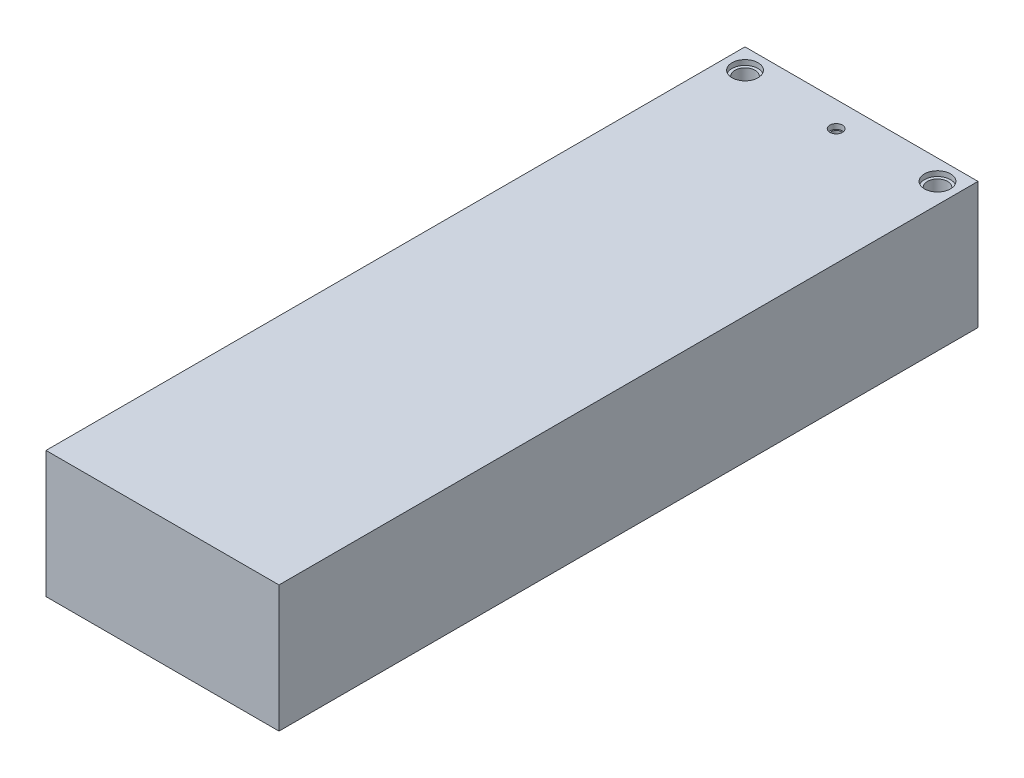
ISO-10303-21;
HEADER;
FILE_DESCRIPTION(('STEP AP214'),'2;1');
FILE_NAME('part.step','',(''),(''),'','','');
FILE_SCHEMA(('AUTOMOTIVE_DESIGN { 1 0 10303 214 1 1 1 1 }'));
ENDSEC;
DATA;
#1=APPLICATION_CONTEXT('core data for automotive mechanical design processes');
#2=APPLICATION_PROTOCOL_DEFINITION('international standard','automotive_design',2000,#1);
#3=PRODUCT_CONTEXT('',#1,'mechanical');
#4=PRODUCT('Part','Part','',(#3));
#5=PRODUCT_RELATED_PRODUCT_CATEGORY('part','',(#4));
#6=PRODUCT_DEFINITION_FORMATION('','',#4);
#7=PRODUCT_DEFINITION_CONTEXT('part definition',#1,'design');
#8=PRODUCT_DEFINITION('design','',#6,#7);
#9=PRODUCT_DEFINITION_SHAPE('','',#8);
#10=(LENGTH_UNIT() NAMED_UNIT(*) SI_UNIT(.MILLI.,.METRE.));
#11=(NAMED_UNIT(*) PLANE_ANGLE_UNIT() SI_UNIT($,.RADIAN.));
#12=(NAMED_UNIT(*) SI_UNIT($,.STERADIAN.) SOLID_ANGLE_UNIT());
#13=UNCERTAINTY_MEASURE_WITH_UNIT(LENGTH_MEASURE(1.E-05),#10,'distance_accuracy_value','');
#14=(GEOMETRIC_REPRESENTATION_CONTEXT(3) GLOBAL_UNCERTAINTY_ASSIGNED_CONTEXT((#13)) GLOBAL_UNIT_ASSIGNED_CONTEXT((#10,
#11,#12)) REPRESENTATION_CONTEXT('',''));
#15=CARTESIAN_POINT('',(0.,0.,0.));
#16=DIRECTION('',(0.,0.,1.));
#17=DIRECTION('',(1.,0.,0.));
#18=AXIS2_PLACEMENT_3D('',#15,#16,#17);
#19=CARTESIAN_POINT('',(-23.,12.5,138.));
#20=DIRECTION('',(1.,0.,0.));
#21=DIRECTION('',(0.,1.,0.));
#22=AXIS2_PLACEMENT_3D('',#19,#20,#21);
#23=PLANE('',#22);
#24=DIRECTION('',(0.,-1.,0.));
#25=VECTOR('',#24,1.);
#26=CARTESIAN_POINT('',(-23.,12.5,0.));
#27=LINE('',#26,#25);
#28=CARTESIAN_POINT('',(-23.,12.5,0.));
#29=VERTEX_POINT('',#28);
#30=CARTESIAN_POINT('',(-23.,-12.5,0.));
#31=VERTEX_POINT('',#30);
#32=EDGE_CURVE('E103',#29,#31,#27,.T.);
#33=ORIENTED_EDGE('',*,*,#32,.T.);
#34=DIRECTION('',(0.,0.,-1.));
#35=VECTOR('',#34,1.);
#36=CARTESIAN_POINT('',(-23.,-12.5,138.));
#37=LINE('',#36,#35);
#38=CARTESIAN_POINT('',(-23.,-12.5,138.));
#39=VERTEX_POINT('',#38);
#40=EDGE_CURVE('E11',#39,#31,#37,.T.);
#41=ORIENTED_EDGE('',*,*,#40,.F.);
#42=DIRECTION('',(0.,-1.,0.));
#43=VECTOR('',#42,1.);
#44=CARTESIAN_POINT('',(-23.,12.5,138.));
#45=LINE('',#44,#43);
#46=CARTESIAN_POINT('',(-23.,12.5,138.));
#47=VERTEX_POINT('',#46);
#48=EDGE_CURVE('E90',#47,#39,#45,.T.);
#49=ORIENTED_EDGE('',*,*,#48,.F.);
#50=DIRECTION('',(0.,0.,-1.));
#51=VECTOR('',#50,1.);
#52=CARTESIAN_POINT('',(-23.,12.5,138.));
#53=LINE('',#52,#51);
#54=EDGE_CURVE('E99',#47,#29,#53,.T.);
#55=ORIENTED_EDGE('',*,*,#54,.T.);
#56=EDGE_LOOP('',(#33,#41,#49,#55));
#57=FACE_BOUND('',#56,.T.);
#58=ADVANCED_FACE('F37',(#57),#23,.F.);
#59=CARTESIAN_POINT('',(-23.,-12.5,138.));
#60=DIRECTION('',(0.,1.,0.));
#61=DIRECTION('',(-1.,0.,0.));
#62=AXIS2_PLACEMENT_3D('',#59,#60,#61);
#63=PLANE('',#62);
#64=DIRECTION('',(1.,0.,0.));
#65=VECTOR('',#64,1.);
#66=CARTESIAN_POINT('',(-23.,-12.5,0.));
#67=LINE('',#66,#65);
#68=CARTESIAN_POINT('',(23.,-12.5,0.));
#69=VERTEX_POINT('',#68);
#70=EDGE_CURVE('E94',#31,#69,#67,.T.);
#71=ORIENTED_EDGE('',*,*,#70,.T.);
#72=DIRECTION('',(0.,0.,-1.));
#73=VECTOR('',#72,1.);
#74=CARTESIAN_POINT('',(23.,-12.5,138.));
#75=LINE('',#74,#73);
#76=CARTESIAN_POINT('',(23.,-12.5,138.));
#77=VERTEX_POINT('',#76);
#78=EDGE_CURVE('E46',#77,#69,#75,.T.);
#79=ORIENTED_EDGE('',*,*,#78,.F.);
#80=DIRECTION('',(1.,0.,0.));
#81=VECTOR('',#80,1.);
#82=CARTESIAN_POINT('',(-23.,-12.5,138.));
#83=LINE('',#82,#81);
#84=EDGE_CURVE('E85',#39,#77,#83,.T.);
#85=ORIENTED_EDGE('',*,*,#84,.F.);
#86=ORIENTED_EDGE('',*,*,#40,.T.);
#87=EDGE_LOOP('',(#71,#79,#85,#86));
#88=FACE_BOUND('',#87,.T.);
#89=ADVANCED_FACE('F93',(#88),#63,.F.);
#90=CARTESIAN_POINT('',(23.,12.5,138.));
#91=DIRECTION('',(-1.,0.,0.));
#92=DIRECTION('',(0.,-1.,0.));
#93=AXIS2_PLACEMENT_3D('',#90,#91,#92);
#94=PLANE('',#93);
#95=DIRECTION('',(0.,1.,0.));
#96=VECTOR('',#95,1.);
#97=CARTESIAN_POINT('',(23.,12.5,0.));
#98=LINE('',#97,#96);
#99=CARTESIAN_POINT('',(23.,12.5,0.));
#100=VERTEX_POINT('',#99);
#101=EDGE_CURVE('E72',#69,#100,#98,.T.);
#102=ORIENTED_EDGE('',*,*,#101,.T.);
#103=DIRECTION('',(0.,0.,-1.));
#104=VECTOR('',#103,1.);
#105=CARTESIAN_POINT('',(23.,12.5,138.));
#106=LINE('',#105,#104);
#107=CARTESIAN_POINT('',(23.,12.5,138.));
#108=VERTEX_POINT('',#107);
#109=EDGE_CURVE('E95',#108,#100,#106,.T.);
#110=ORIENTED_EDGE('',*,*,#109,.F.);
#111=DIRECTION('',(0.,1.,0.));
#112=VECTOR('',#111,1.);
#113=CARTESIAN_POINT('',(23.,12.5,138.));
#114=LINE('',#113,#112);
#115=EDGE_CURVE('E88',#77,#108,#114,.T.);
#116=ORIENTED_EDGE('',*,*,#115,.F.);
#117=ORIENTED_EDGE('',*,*,#78,.T.);
#118=EDGE_LOOP('',(#102,#110,#116,#117));
#119=FACE_BOUND('',#118,.T.);
#120=ADVANCED_FACE('F97',(#119),#94,.F.);
#121=CARTESIAN_POINT('',(-23.,12.5,138.));
#122=DIRECTION('',(0.,-1.,0.));
#123=DIRECTION('',(1.,0.,0.));
#124=AXIS2_PLACEMENT_3D('',#121,#122,#123);
#125=PLANE('',#124);
#126=CARTESIAN_POINT('',(19.,12.5,4.));
#127=DIRECTION('',(0.,1.,0.));
#128=DIRECTION('',(-1.,0.,0.));
#129=AXIS2_PLACEMENT_3D('',#126,#127,#128);
#130=CIRCLE('',#129,2.575);
#131=CARTESIAN_POINT('',(16.425,12.5,4.));
#132=VERTEX_POINT('',#131);
#133=EDGE_CURVE('E114',#132,#132,#130,.T.);
#134=ORIENTED_EDGE('',*,*,#133,.F.);
#135=EDGE_LOOP('',(#134));
#136=FACE_BOUND('',#135,.T.);
#137=CARTESIAN_POINT('',(0.,12.5,5.));
#138=DIRECTION('',(0.,1.,0.));
#139=DIRECTION('',(-1.,0.,0.));
#140=AXIS2_PLACEMENT_3D('',#137,#138,#139);
#141=CIRCLE('',#140,1.25);
#142=CARTESIAN_POINT('',(-1.25,12.5,5.));
#143=VERTEX_POINT('',#142);
#144=EDGE_CURVE('E134',#143,#143,#141,.T.);
#145=ORIENTED_EDGE('',*,*,#144,.F.);
#146=EDGE_LOOP('',(#145));
#147=FACE_BOUND('',#146,.T.);
#148=CARTESIAN_POINT('',(-19.,12.5,4.));
#149=DIRECTION('',(0.,1.,0.));
#150=DIRECTION('',(-1.,0.,0.));
#151=AXIS2_PLACEMENT_3D('',#148,#149,#150);
#152=CIRCLE('',#151,2.575);
#153=CARTESIAN_POINT('',(-21.575,12.5,4.));
#154=VERTEX_POINT('',#153);
#155=EDGE_CURVE('E140',#154,#154,#152,.T.);
#156=ORIENTED_EDGE('',*,*,#155,.F.);
#157=EDGE_LOOP('',(#156));
#158=FACE_BOUND('',#157,.T.);
#159=DIRECTION('',(-1.,0.,0.));
#160=VECTOR('',#159,1.);
#161=CARTESIAN_POINT('',(-23.,12.5,0.));
#162=LINE('',#161,#160);
#163=EDGE_CURVE('E78',#100,#29,#162,.T.);
#164=ORIENTED_EDGE('',*,*,#163,.T.);
#165=ORIENTED_EDGE('',*,*,#54,.F.);
#166=DIRECTION('',(-1.,0.,0.));
#167=VECTOR('',#166,1.);
#168=CARTESIAN_POINT('',(-23.,12.5,138.));
#169=LINE('',#168,#167);
#170=EDGE_CURVE('E55',#108,#47,#169,.T.);
#171=ORIENTED_EDGE('',*,*,#170,.F.);
#172=ORIENTED_EDGE('',*,*,#109,.T.);
#173=EDGE_LOOP('',(#164,#165,#171,#172));
#174=FACE_BOUND('',#173,.T.);
#175=ADVANCED_FACE('F150',(#136,#147,#158,#174),#125,.F.);
#176=CARTESIAN_POINT('',(0.,0.,138.));
#177=DIRECTION('',(0.,0.,1.));
#178=DIRECTION('',(1.,0.,0.));
#179=AXIS2_PLACEMENT_3D('',#176,#177,#178);
#180=PLANE('',#179);
#181=ORIENTED_EDGE('',*,*,#48,.T.);
#182=ORIENTED_EDGE('',*,*,#84,.T.);
#183=ORIENTED_EDGE('',*,*,#115,.T.);
#184=ORIENTED_EDGE('',*,*,#170,.T.);
#185=EDGE_LOOP('',(#181,#182,#183,#184));
#186=FACE_BOUND('',#185,.T.);
#187=ADVANCED_FACE('F86',(#186),#180,.T.);
#188=CARTESIAN_POINT('',(0.,0.,0.));
#189=DIRECTION('',(0.,0.,1.));
#190=DIRECTION('',(1.,0.,0.));
#191=AXIS2_PLACEMENT_3D('',#188,#189,#190);
#192=PLANE('',#191);
#193=ORIENTED_EDGE('',*,*,#32,.F.);
#194=ORIENTED_EDGE('',*,*,#163,.F.);
#195=ORIENTED_EDGE('',*,*,#101,.F.);
#196=ORIENTED_EDGE('',*,*,#70,.F.);
#197=EDGE_LOOP('',(#193,#194,#195,#196));
#198=FACE_BOUND('',#197,.T.);
#199=ADVANCED_FACE('F158',(#198),#192,.F.);
#200=CARTESIAN_POINT('',(-19.,11.5,4.));
#201=DIRECTION('',(0.,1.,0.));
#202=DIRECTION('',(-1.,0.,0.));
#203=AXIS2_PLACEMENT_3D('',#200,#201,#202);
#204=CYLINDRICAL_SURFACE('',#203,2.575);
#205=CARTESIAN_POINT('',(-19.,11.5,4.));
#206=DIRECTION('',(0.,1.,0.));
#207=DIRECTION('',(-1.,0.,0.));
#208=AXIS2_PLACEMENT_3D('',#205,#206,#207);
#209=CIRCLE('',#208,2.575);
#210=CARTESIAN_POINT('',(-21.575,11.5,4.));
#211=VERTEX_POINT('',#210);
#212=EDGE_CURVE('E106',#211,#211,#209,.T.);
#213=ORIENTED_EDGE('',*,*,#212,.F.);
#214=EDGE_LOOP('',(#213));
#215=FACE_BOUND('',#214,.T.);
#216=ORIENTED_EDGE('',*,*,#155,.T.);
#217=EDGE_LOOP('',(#216));
#218=FACE_BOUND('',#217,.T.);
#219=ADVANCED_FACE('F148',(#215,#218),#204,.F.);
#220=CARTESIAN_POINT('',(-19.,11.5,4.));
#221=DIRECTION('',(0.,1.,0.));
#222=DIRECTION('',(-1.,0.,0.));
#223=AXIS2_PLACEMENT_3D('',#220,#221,#222);
#224=PLANE('',#223);
#225=CARTESIAN_POINT('',(-19.,11.5,4.));
#226=DIRECTION('',(0.,1.,0.));
#227=DIRECTION('',(-1.,0.,0.));
#228=AXIS2_PLACEMENT_3D('',#225,#226,#227);
#229=CIRCLE('',#228,2.);
#230=CARTESIAN_POINT('',(-21.,11.5,4.));
#231=VERTEX_POINT('',#230);
#232=EDGE_CURVE('E112',#231,#231,#229,.T.);
#233=ORIENTED_EDGE('',*,*,#232,.F.);
#234=EDGE_LOOP('',(#233));
#235=FACE_BOUND('',#234,.T.);
#236=ORIENTED_EDGE('',*,*,#212,.T.);
#237=EDGE_LOOP('',(#236));
#238=FACE_BOUND('',#237,.T.);
#239=ADVANCED_FACE('F175',(#235,#238),#224,.T.);
#240=CARTESIAN_POINT('',(0.,11.5,5.));
#241=DIRECTION('',(0.,1.,0.));
#242=DIRECTION('',(-1.,0.,0.));
#243=AXIS2_PLACEMENT_3D('',#240,#241,#242);
#244=CYLINDRICAL_SURFACE('',#243,1.25);
#245=CARTESIAN_POINT('',(0.,11.5,5.));
#246=DIRECTION('',(0.,1.,0.));
#247=DIRECTION('',(-1.,0.,0.));
#248=AXIS2_PLACEMENT_3D('',#245,#246,#247);
#249=CIRCLE('',#248,1.25);
#250=CARTESIAN_POINT('',(-1.25,11.5,5.));
#251=VERTEX_POINT('',#250);
#252=EDGE_CURVE('E137',#251,#251,#249,.T.);
#253=ORIENTED_EDGE('',*,*,#252,.F.);
#254=EDGE_LOOP('',(#253));
#255=FACE_BOUND('',#254,.T.);
#256=ORIENTED_EDGE('',*,*,#144,.T.);
#257=EDGE_LOOP('',(#256));
#258=FACE_BOUND('',#257,.T.);
#259=ADVANCED_FACE('F181',(#255,#258),#244,.F.);
#260=CARTESIAN_POINT('',(0.,11.5,5.));
#261=DIRECTION('',(0.,1.,0.));
#262=DIRECTION('',(-1.,0.,0.));
#263=AXIS2_PLACEMENT_3D('',#260,#261,#262);
#264=PLANE('',#263);
#265=CARTESIAN_POINT('',(0.,11.5,5.));
#266=DIRECTION('',(0.,1.,0.));
#267=DIRECTION('',(-1.,0.,0.));
#268=AXIS2_PLACEMENT_3D('',#265,#266,#267);
#269=CIRCLE('',#268,1.);
#270=CARTESIAN_POINT('',(-0.999999999999999,11.5,5.));
#271=VERTEX_POINT('',#270);
#272=EDGE_CURVE('E40',#271,#271,#269,.T.);
#273=ORIENTED_EDGE('',*,*,#272,.F.);
#274=EDGE_LOOP('',(#273));
#275=FACE_BOUND('',#274,.T.);
#276=ORIENTED_EDGE('',*,*,#252,.T.);
#277=EDGE_LOOP('',(#276));
#278=FACE_BOUND('',#277,.T.);
#279=ADVANCED_FACE('F185',(#275,#278),#264,.T.);
#280=CARTESIAN_POINT('',(19.,11.5,4.));
#281=DIRECTION('',(0.,1.,0.));
#282=DIRECTION('',(-1.,0.,0.));
#283=AXIS2_PLACEMENT_3D('',#280,#281,#282);
#284=CYLINDRICAL_SURFACE('',#283,2.575);
#285=CARTESIAN_POINT('',(19.,11.5,4.));
#286=DIRECTION('',(0.,1.,0.));
#287=DIRECTION('',(-1.,0.,0.));
#288=AXIS2_PLACEMENT_3D('',#285,#286,#287);
#289=CIRCLE('',#288,2.575);
#290=CARTESIAN_POINT('',(16.425,11.5,4.));
#291=VERTEX_POINT('',#290);
#292=EDGE_CURVE('E131',#291,#291,#289,.T.);
#293=ORIENTED_EDGE('',*,*,#292,.F.);
#294=EDGE_LOOP('',(#293));
#295=FACE_BOUND('',#294,.T.);
#296=ORIENTED_EDGE('',*,*,#133,.T.);
#297=EDGE_LOOP('',(#296));
#298=FACE_BOUND('',#297,.T.);
#299=ADVANCED_FACE('F189',(#295,#298),#284,.F.);
#300=CARTESIAN_POINT('',(19.,11.5,4.));
#301=DIRECTION('',(0.,1.,0.));
#302=DIRECTION('',(-1.,0.,0.));
#303=AXIS2_PLACEMENT_3D('',#300,#301,#302);
#304=PLANE('',#303);
#305=CARTESIAN_POINT('',(19.,11.5,4.));
#306=DIRECTION('',(0.,1.,0.));
#307=DIRECTION('',(-1.,0.,0.));
#308=AXIS2_PLACEMENT_3D('',#305,#306,#307);
#309=CIRCLE('',#308,2.);
#310=CARTESIAN_POINT('',(17.,11.5,4.));
#311=VERTEX_POINT('',#310);
#312=EDGE_CURVE('E116',#311,#311,#309,.T.);
#313=ORIENTED_EDGE('',*,*,#312,.F.);
#314=EDGE_LOOP('',(#313));
#315=FACE_BOUND('',#314,.T.);
#316=ORIENTED_EDGE('',*,*,#292,.T.);
#317=EDGE_LOOP('',(#316));
#318=FACE_BOUND('',#317,.T.);
#319=ADVANCED_FACE('F193',(#315,#318),#304,.T.);
#320=CARTESIAN_POINT('',(-19.,-4.00000000000001,4.));
#321=DIRECTION('',(0.,1.,0.));
#322=DIRECTION('',(-1.,0.,0.));
#323=AXIS2_PLACEMENT_3D('',#320,#321,#322);
#324=CYLINDRICAL_SURFACE('',#323,2.);
#325=ORIENTED_EDGE('',*,*,#232,.T.);
#326=EDGE_LOOP('',(#325));
#327=FACE_BOUND('',#326,.T.);
#328=CARTESIAN_POINT('',(-19.,-4.00000000000001,4.));
#329=DIRECTION('',(0.,1.,0.));
#330=DIRECTION('',(-1.,0.,0.));
#331=AXIS2_PLACEMENT_3D('',#328,#329,#330);
#332=CIRCLE('',#331,2.);
#333=CARTESIAN_POINT('',(-21.,-4.00000000000001,4.));
#334=VERTEX_POINT('',#333);
#335=EDGE_CURVE('E115',#334,#334,#332,.T.);
#336=ORIENTED_EDGE('',*,*,#335,.F.);
#337=EDGE_LOOP('',(#336));
#338=FACE_BOUND('',#337,.T.);
#339=ADVANCED_FACE('F197',(#327,#338),#324,.F.);
#340=CARTESIAN_POINT('',(-19.,-4.00000000000001,4.));
#341=DIRECTION('',(0.,1.,0.));
#342=DIRECTION('',(-1.,0.,0.));
#343=AXIS2_PLACEMENT_3D('',#340,#341,#342);
#344=PLANE('',#343);
#345=ORIENTED_EDGE('',*,*,#335,.T.);
#346=EDGE_LOOP('',(#345));
#347=FACE_BOUND('',#346,.T.);
#348=ADVANCED_FACE('F201',(#347),#344,.T.);
#349=CARTESIAN_POINT('',(19.,-4.00000000000001,4.));
#350=DIRECTION('',(0.,1.,0.));
#351=DIRECTION('',(-1.,0.,0.));
#352=AXIS2_PLACEMENT_3D('',#349,#350,#351);
#353=CYLINDRICAL_SURFACE('',#352,2.);
#354=ORIENTED_EDGE('',*,*,#312,.T.);
#355=EDGE_LOOP('',(#354));
#356=FACE_BOUND('',#355,.T.);
#357=CARTESIAN_POINT('',(19.,-4.00000000000001,4.));
#358=DIRECTION('',(0.,1.,0.));
#359=DIRECTION('',(-1.,0.,0.));
#360=AXIS2_PLACEMENT_3D('',#357,#358,#359);
#361=CIRCLE('',#360,2.);
#362=CARTESIAN_POINT('',(17.,-4.00000000000001,4.));
#363=VERTEX_POINT('',#362);
#364=EDGE_CURVE('E118',#363,#363,#361,.T.);
#365=ORIENTED_EDGE('',*,*,#364,.F.);
#366=EDGE_LOOP('',(#365));
#367=FACE_BOUND('',#366,.T.);
#368=ADVANCED_FACE('F205',(#356,#367),#353,.F.);
#369=CARTESIAN_POINT('',(19.,-4.00000000000001,4.));
#370=DIRECTION('',(0.,1.,0.));
#371=DIRECTION('',(-1.,0.,0.));
#372=AXIS2_PLACEMENT_3D('',#369,#370,#371);
#373=PLANE('',#372);
#374=ORIENTED_EDGE('',*,*,#364,.T.);
#375=EDGE_LOOP('',(#374));
#376=FACE_BOUND('',#375,.T.);
#377=ADVANCED_FACE('F209',(#376),#373,.T.);
#378=CARTESIAN_POINT('',(0.,-4.00000000000001,5.));
#379=DIRECTION('',(0.,1.,0.));
#380=DIRECTION('',(-1.,0.,0.));
#381=AXIS2_PLACEMENT_3D('',#378,#379,#380);
#382=CYLINDRICAL_SURFACE('',#381,1.);
#383=ORIENTED_EDGE('',*,*,#272,.T.);
#384=EDGE_LOOP('',(#383));
#385=FACE_BOUND('',#384,.T.);
#386=CARTESIAN_POINT('',(0.,-4.00000000000001,5.));
#387=DIRECTION('',(0.,1.,0.));
#388=DIRECTION('',(-1.,0.,0.));
#389=AXIS2_PLACEMENT_3D('',#386,#387,#388);
#390=CIRCLE('',#389,1.);
#391=CARTESIAN_POINT('',(-1.,-4.00000000000001,5.));
#392=VERTEX_POINT('',#391);
#393=EDGE_CURVE('E128',#392,#392,#390,.T.);
#394=ORIENTED_EDGE('',*,*,#393,.F.);
#395=EDGE_LOOP('',(#394));
#396=FACE_BOUND('',#395,.T.);
#397=ADVANCED_FACE('F212',(#385,#396),#382,.F.);
#398=CARTESIAN_POINT('',(0.,-4.00000000000001,5.));
#399=DIRECTION('',(0.,1.,0.));
#400=DIRECTION('',(-1.,0.,0.));
#401=AXIS2_PLACEMENT_3D('',#398,#399,#400);
#402=PLANE('',#401);
#403=ORIENTED_EDGE('',*,*,#393,.T.);
#404=EDGE_LOOP('',(#403));
#405=FACE_BOUND('',#404,.T.);
#406=ADVANCED_FACE('F215',(#405),#402,.T.);
#407=CLOSED_SHELL('',(#58,#89,#120,#175,#187,#199,#219,#239,#259,#279,#299,#319,#339,#348,#368,
#377,#397,#406));
#408=MANIFOLD_SOLID_BREP('B2',#407);
#409=ADVANCED_BREP_SHAPE_REPRESENTATION('',(#18,#408),#14);
#410=SHAPE_DEFINITION_REPRESENTATION(#9,#409);
ENDSEC;
END-ISO-10303-21;
